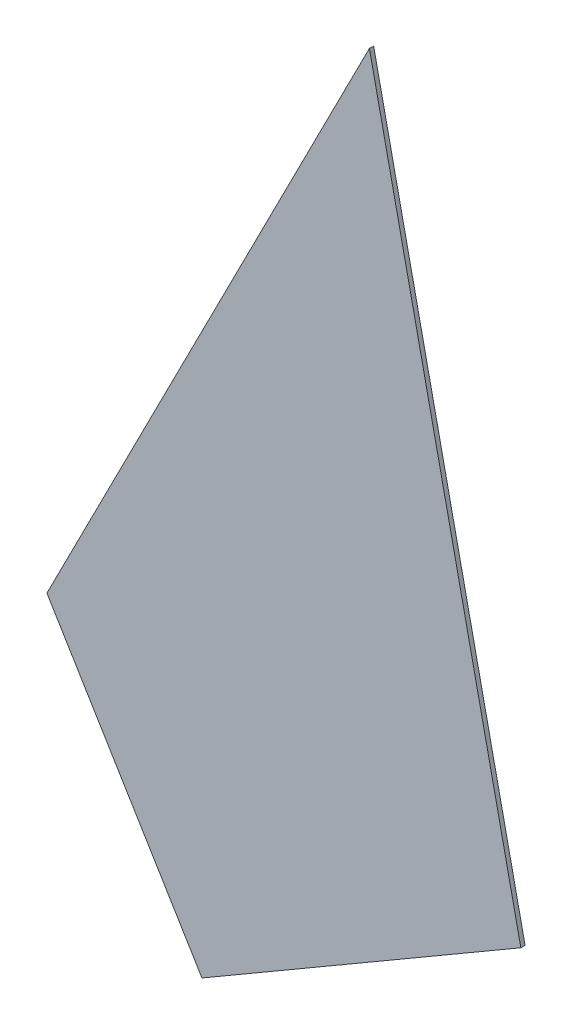
ISO-10303-21;
HEADER;
FILE_DESCRIPTION(('STEP AP214'),'2;1');
FILE_NAME('part.step','',(''),(''),'','','');
FILE_SCHEMA(('AUTOMOTIVE_DESIGN { 1 0 10303 214 1 1 1 1 }'));
ENDSEC;
DATA;
#1=APPLICATION_CONTEXT('core data for automotive mechanical design processes');
#2=APPLICATION_PROTOCOL_DEFINITION('international standard','automotive_design',2000,#1);
#3=PRODUCT_CONTEXT('',#1,'mechanical');
#4=PRODUCT('Part','Part','',(#3));
#5=PRODUCT_RELATED_PRODUCT_CATEGORY('part','',(#4));
#6=PRODUCT_DEFINITION_FORMATION('','',#4);
#7=PRODUCT_DEFINITION_CONTEXT('part definition',#1,'design');
#8=PRODUCT_DEFINITION('design','',#6,#7);
#9=PRODUCT_DEFINITION_SHAPE('','',#8);
#10=(LENGTH_UNIT() NAMED_UNIT(*) SI_UNIT(.MILLI.,.METRE.));
#11=(NAMED_UNIT(*) PLANE_ANGLE_UNIT() SI_UNIT($,.RADIAN.));
#12=(NAMED_UNIT(*) SI_UNIT($,.STERADIAN.) SOLID_ANGLE_UNIT());
#13=UNCERTAINTY_MEASURE_WITH_UNIT(LENGTH_MEASURE(1.E-05),#10,'distance_accuracy_value','');
#14=(GEOMETRIC_REPRESENTATION_CONTEXT(3) GLOBAL_UNCERTAINTY_ASSIGNED_CONTEXT((#13)) GLOBAL_UNIT_ASSIGNED_CONTEXT((#10,
#11,#12)) REPRESENTATION_CONTEXT('',''));
#15=CARTESIAN_POINT('',(0.,0.,0.));
#16=DIRECTION('',(0.,0.,1.));
#17=DIRECTION('',(1.,0.,0.));
#18=AXIS2_PLACEMENT_3D('',#15,#16,#17);
#19=CARTESIAN_POINT('',(1871.10251330996,3149.01598861181,100.));
#20=DIRECTION('',(0.503034863617072,-0.864266119887708,0.));
#21=DIRECTION('',(0.864266119887708,0.503034863617072,0.));
#22=AXIS2_PLACEMENT_3D('',#19,#20,#21);
#23=PLANE('',#22);
#24=DIRECTION('',(0.864266119887708,0.503034863617072,0.));
#25=VECTOR('',#24,1.);
#26=CARTESIAN_POINT('',(1871.10251330996,3149.01598861181,102.));
#27=LINE('',#26,#25);
#28=CARTESIAN_POINT('',(1720.09424768663,3061.12359001501,102.));
#29=VERTEX_POINT('',#28);
#30=CARTESIAN_POINT('',(1871.10251330996,3149.01598861181,102.));
#31=VERTEX_POINT('',#30);
#32=EDGE_CURVE('E105',#29,#31,#27,.T.);
#33=ORIENTED_EDGE('',*,*,#32,.F.);
#34=DIRECTION('',(0.,0.,1.));
#35=VECTOR('',#34,1.);
#36=CARTESIAN_POINT('',(1720.09424768663,3061.12359001501,100.));
#37=LINE('',#36,#35);
#38=CARTESIAN_POINT('',(1720.09424768663,3061.12359001501,100.));
#39=VERTEX_POINT('',#38);
#40=EDGE_CURVE('E11',#39,#29,#37,.T.);
#41=ORIENTED_EDGE('',*,*,#40,.F.);
#42=DIRECTION('',(0.864266119887708,0.503034863617072,0.));
#43=VECTOR('',#42,1.);
#44=CARTESIAN_POINT('',(1871.10251330996,3149.01598861181,100.));
#45=LINE('',#44,#43);
#46=CARTESIAN_POINT('',(1871.10251330996,3149.01598861181,100.));
#47=VERTEX_POINT('',#46);
#48=EDGE_CURVE('E99',#39,#47,#45,.T.);
#49=ORIENTED_EDGE('',*,*,#48,.T.);
#50=DIRECTION('',(0.,0.,1.));
#51=VECTOR('',#50,1.);
#52=CARTESIAN_POINT('',(1871.10251330996,3149.01598861181,100.));
#53=LINE('',#52,#51);
#54=EDGE_CURVE('E44',#47,#31,#53,.T.);
#55=ORIENTED_EDGE('',*,*,#54,.T.);
#56=EDGE_LOOP('',(#33,#41,#49,#55));
#57=FACE_BOUND('',#56,.T.);
#58=ADVANCED_FACE('F41',(#57),#23,.T.);
#59=CARTESIAN_POINT('',(1720.09424768663,3061.12359001501,100.));
#60=DIRECTION('',(-0.855234381676338,-0.518241403593626,0.));
#61=DIRECTION('',(0.518241403593626,-0.855234381676338,0.));
#62=AXIS2_PLACEMENT_3D('',#59,#60,#61);
#63=PLANE('',#62);
#64=DIRECTION('',(0.518241403593626,-0.855234381676338,0.));
#65=VECTOR('',#64,1.);
#66=CARTESIAN_POINT('',(1720.09424768663,3061.12359001501,102.));
#67=LINE('',#66,#65);
#68=CARTESIAN_POINT('',(1646.69257034599,3182.25562944514,102.));
#69=VERTEX_POINT('',#68);
#70=EDGE_CURVE('E101',#69,#29,#67,.T.);
#71=ORIENTED_EDGE('',*,*,#70,.F.);
#72=DIRECTION('',(0.,0.,1.));
#73=VECTOR('',#72,1.);
#74=CARTESIAN_POINT('',(1646.69257034599,3182.25562944514,100.));
#75=LINE('',#74,#73);
#76=CARTESIAN_POINT('',(1646.69257034599,3182.25562944514,100.));
#77=VERTEX_POINT('',#76);
#78=EDGE_CURVE('E50',#77,#69,#75,.T.);
#79=ORIENTED_EDGE('',*,*,#78,.F.);
#80=DIRECTION('',(0.518241403593626,-0.855234381676338,0.));
#81=VECTOR('',#80,1.);
#82=CARTESIAN_POINT('',(1720.09424768663,3061.12359001501,100.));
#83=LINE('',#82,#81);
#84=EDGE_CURVE('E96',#77,#39,#83,.T.);
#85=ORIENTED_EDGE('',*,*,#84,.T.);
#86=ORIENTED_EDGE('',*,*,#40,.T.);
#87=EDGE_LOOP('',(#71,#79,#85,#86));
#88=FACE_BOUND('',#87,.T.);
#89=ADVANCED_FACE('F115',(#88),#63,.T.);
#90=CARTESIAN_POINT('',(1799.39765340751,3481.95622970571,100.));
#91=DIRECTION('',(-0.891006524188368,0.453990499739548,0.));
#92=DIRECTION('',(-0.453990499739548,-0.891006524188368,0.));
#93=AXIS2_PLACEMENT_3D('',#90,#91,#92);
#94=PLANE('',#93);
#95=DIRECTION('',(-0.453990499739548,-0.891006524188368,0.));
#96=VECTOR('',#95,1.);
#97=CARTESIAN_POINT('',(1799.39765340751,3481.95622970571,102.));
#98=LINE('',#97,#96);
#99=CARTESIAN_POINT('',(1799.39765340751,3481.95622970571,102.));
#100=VERTEX_POINT('',#99);
#101=EDGE_CURVE('E91',#100,#69,#98,.T.);
#102=ORIENTED_EDGE('',*,*,#101,.F.);
#103=DIRECTION('',(0.,0.,1.));
#104=VECTOR('',#103,1.);
#105=CARTESIAN_POINT('',(1799.39765340751,3481.95622970571,100.));
#106=LINE('',#105,#104);
#107=CARTESIAN_POINT('',(1799.39765340751,3481.95622970571,100.));
#108=VERTEX_POINT('',#107);
#109=EDGE_CURVE('E86',#108,#100,#106,.T.);
#110=ORIENTED_EDGE('',*,*,#109,.F.);
#111=DIRECTION('',(-0.453990499739548,-0.891006524188368,0.));
#112=VECTOR('',#111,1.);
#113=CARTESIAN_POINT('',(1799.39765340751,3481.95622970571,100.));
#114=LINE('',#113,#112);
#115=EDGE_CURVE('E89',#108,#77,#114,.T.);
#116=ORIENTED_EDGE('',*,*,#115,.T.);
#117=ORIENTED_EDGE('',*,*,#78,.T.);
#118=EDGE_LOOP('',(#102,#110,#116,#117));
#119=FACE_BOUND('',#118,.T.);
#120=ADVANCED_FACE('F88',(#119),#94,.T.);
#121=CARTESIAN_POINT('',(1871.10251330996,3149.01598861181,100.));
#122=DIRECTION('',(0.977585011989274,0.210541075170457,0.));
#123=DIRECTION('',(-0.210541075170457,0.977585011989274,0.));
#124=AXIS2_PLACEMENT_3D('',#121,#122,#123);
#125=PLANE('',#124);
#126=DIRECTION('',(-0.210541075170457,0.977585011989273,0.));
#127=VECTOR('',#126,1.);
#128=CARTESIAN_POINT('',(1871.10251330996,3149.01598861181,102.));
#129=LINE('',#128,#127);
#130=EDGE_CURVE('E108',#31,#100,#129,.T.);
#131=ORIENTED_EDGE('',*,*,#130,.F.);
#132=ORIENTED_EDGE('',*,*,#54,.F.);
#133=DIRECTION('',(-0.210541075170457,0.977585011989273,0.));
#134=VECTOR('',#133,1.);
#135=CARTESIAN_POINT('',(1871.10251330996,3149.01598861181,100.));
#136=LINE('',#135,#134);
#137=EDGE_CURVE('E95',#47,#108,#136,.T.);
#138=ORIENTED_EDGE('',*,*,#137,.T.);
#139=ORIENTED_EDGE('',*,*,#109,.T.);
#140=EDGE_LOOP('',(#131,#132,#138,#139));
#141=FACE_BOUND('',#140,.T.);
#142=ADVANCED_FACE('F98',(#141),#125,.T.);
#143=CARTESIAN_POINT('',(0.,0.,100.));
#144=DIRECTION('',(0.,0.,-1.));
#145=DIRECTION('',(-1.,0.,0.));
#146=AXIS2_PLACEMENT_3D('',#143,#144,#145);
#147=PLANE('',#146);
#148=ORIENTED_EDGE('',*,*,#48,.F.);
#149=ORIENTED_EDGE('',*,*,#84,.F.);
#150=ORIENTED_EDGE('',*,*,#115,.F.);
#151=ORIENTED_EDGE('',*,*,#137,.F.);
#152=EDGE_LOOP('',(#148,#149,#150,#151));
#153=FACE_BOUND('',#152,.T.);
#154=ADVANCED_FACE('F94',(#153),#147,.T.);
#155=CARTESIAN_POINT('',(0.,0.,102.));
#156=DIRECTION('',(0.,0.,-1.));
#157=DIRECTION('',(-1.,0.,0.));
#158=AXIS2_PLACEMENT_3D('',#155,#156,#157);
#159=PLANE('',#158);
#160=ORIENTED_EDGE('',*,*,#32,.T.);
#161=ORIENTED_EDGE('',*,*,#130,.T.);
#162=ORIENTED_EDGE('',*,*,#101,.T.);
#163=ORIENTED_EDGE('',*,*,#70,.T.);
#164=EDGE_LOOP('',(#160,#161,#162,#163));
#165=FACE_BOUND('',#164,.T.);
#166=ADVANCED_FACE('F114',(#165),#159,.F.);
#167=CLOSED_SHELL('',(#58,#89,#120,#142,#154,#166));
#168=MANIFOLD_SOLID_BREP('B2',#167);
#169=ADVANCED_BREP_SHAPE_REPRESENTATION('',(#18,#168),#14);
#170=SHAPE_DEFINITION_REPRESENTATION(#9,#169);
ENDSEC;
END-ISO-10303-21;
